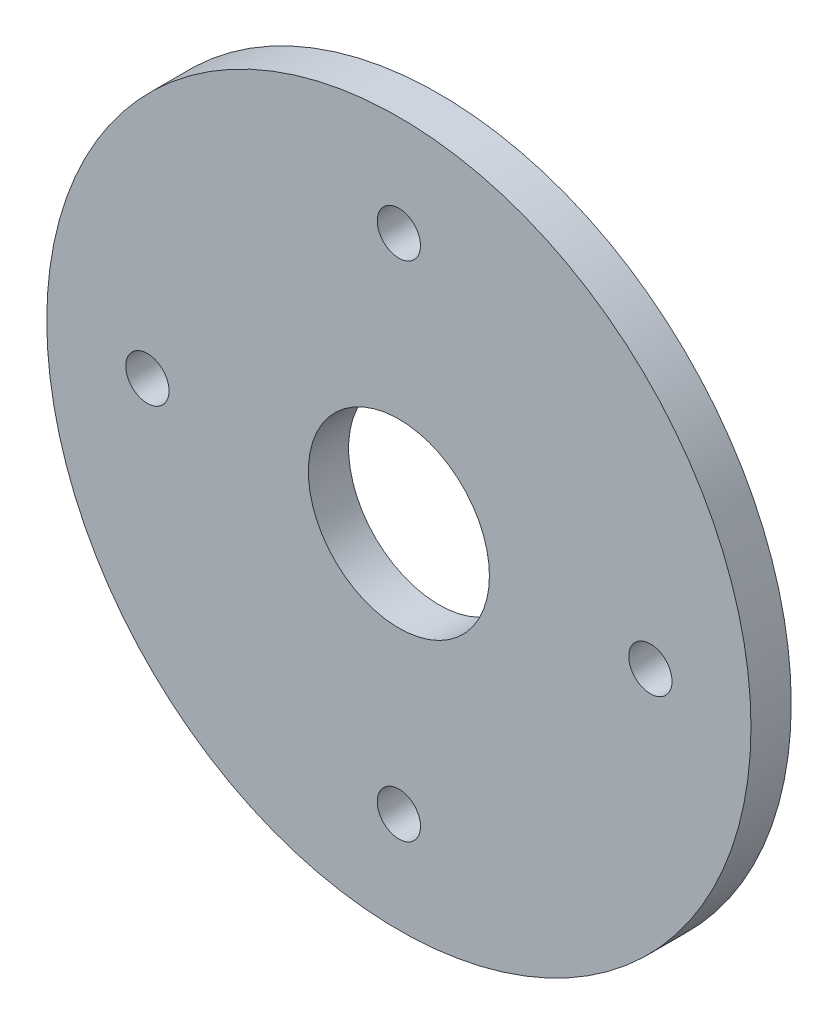
ISO-10303-21;
HEADER;
FILE_DESCRIPTION(('STEP AP214'),'2;1');
FILE_NAME('part.step','',(''),(''),'','','');
FILE_SCHEMA(('AUTOMOTIVE_DESIGN { 1 0 10303 214 1 1 1 1 }'));
ENDSEC;
DATA;
#1=APPLICATION_CONTEXT('core data for automotive mechanical design processes');
#2=APPLICATION_PROTOCOL_DEFINITION('international standard','automotive_design',2000,#1);
#3=PRODUCT_CONTEXT('',#1,'mechanical');
#4=PRODUCT('Part','Part','',(#3));
#5=PRODUCT_RELATED_PRODUCT_CATEGORY('part','',(#4));
#6=PRODUCT_DEFINITION_FORMATION('','',#4);
#7=PRODUCT_DEFINITION_CONTEXT('part definition',#1,'design');
#8=PRODUCT_DEFINITION('design','',#6,#7);
#9=PRODUCT_DEFINITION_SHAPE('','',#8);
#10=(LENGTH_UNIT() NAMED_UNIT(*) SI_UNIT(.MILLI.,.METRE.));
#11=(NAMED_UNIT(*) PLANE_ANGLE_UNIT() SI_UNIT($,.RADIAN.));
#12=(NAMED_UNIT(*) SI_UNIT($,.STERADIAN.) SOLID_ANGLE_UNIT());
#13=UNCERTAINTY_MEASURE_WITH_UNIT(LENGTH_MEASURE(1.E-05),#10,'distance_accuracy_value','');
#14=(GEOMETRIC_REPRESENTATION_CONTEXT(3) GLOBAL_UNCERTAINTY_ASSIGNED_CONTEXT((#13)) GLOBAL_UNIT_ASSIGNED_CONTEXT((#10,
#11,#12)) REPRESENTATION_CONTEXT('',''));
#15=CARTESIAN_POINT('',(0.,0.,0.));
#16=DIRECTION('',(0.,0.,1.));
#17=DIRECTION('',(1.,0.,0.));
#18=AXIS2_PLACEMENT_3D('',#15,#16,#17);
#19=CARTESIAN_POINT('',(-35.,145.,4.));
#20=DIRECTION('',(0.,0.,-1.));
#21=DIRECTION('',(-1.,0.,0.));
#22=AXIS2_PLACEMENT_3D('',#19,#20,#21);
#23=CYLINDRICAL_SURFACE('',#22,9.00000000000001);
#24=CARTESIAN_POINT('',(-35.,145.,4.));
#25=DIRECTION('',(0.,0.,1.));
#26=DIRECTION('',(1.,0.,0.));
#27=AXIS2_PLACEMENT_3D('',#24,#25,#26);
#28=CIRCLE('',#27,9.00000000000001);
#29=CARTESIAN_POINT('',(-26.,145.,4.));
#30=VERTEX_POINT('',#29);
#31=EDGE_CURVE('E41',#30,#30,#28,.T.);
#32=ORIENTED_EDGE('',*,*,#31,.T.);
#33=EDGE_LOOP('',(#32));
#34=FACE_BOUND('',#33,.T.);
#35=CARTESIAN_POINT('',(-35.,145.,0.));
#36=DIRECTION('',(0.,0.,1.));
#37=DIRECTION('',(1.,0.,0.));
#38=AXIS2_PLACEMENT_3D('',#35,#36,#37);
#39=CIRCLE('',#38,9.00000000000001);
#40=CARTESIAN_POINT('',(-26.,145.,0.));
#41=VERTEX_POINT('',#40);
#42=EDGE_CURVE('E48',#41,#41,#39,.T.);
#43=ORIENTED_EDGE('',*,*,#42,.F.);
#44=EDGE_LOOP('',(#43));
#45=FACE_BOUND('',#44,.T.);
#46=ADVANCED_FACE('F34',(#34,#45),#23,.F.);
#47=CARTESIAN_POINT('',(-35.,145.,4.));
#48=DIRECTION('',(0.,0.,-1.));
#49=DIRECTION('',(-1.,0.,0.));
#50=AXIS2_PLACEMENT_3D('',#47,#48,#49);
#51=CYLINDRICAL_SURFACE('',#50,35.);
#52=CARTESIAN_POINT('',(-35.,145.,4.));
#53=DIRECTION('',(0.,0.,1.));
#54=DIRECTION('',(1.,0.,0.));
#55=AXIS2_PLACEMENT_3D('',#52,#53,#54);
#56=CIRCLE('',#55,35.);
#57=CARTESIAN_POINT('',(0.,145.,4.));
#58=VERTEX_POINT('',#57);
#59=EDGE_CURVE('E10',#58,#58,#56,.T.);
#60=ORIENTED_EDGE('',*,*,#59,.F.);
#61=EDGE_LOOP('',(#60));
#62=FACE_BOUND('',#61,.T.);
#63=CARTESIAN_POINT('',(-35.,145.,0.));
#64=DIRECTION('',(0.,0.,1.));
#65=DIRECTION('',(1.,0.,0.));
#66=AXIS2_PLACEMENT_3D('',#63,#64,#65);
#67=CIRCLE('',#66,35.);
#68=CARTESIAN_POINT('',(0.,145.,0.));
#69=VERTEX_POINT('',#68);
#70=EDGE_CURVE('E37',#69,#69,#67,.T.);
#71=ORIENTED_EDGE('',*,*,#70,.T.);
#72=EDGE_LOOP('',(#71));
#73=FACE_BOUND('',#72,.T.);
#74=ADVANCED_FACE('F86',(#62,#73),#51,.T.);
#75=CARTESIAN_POINT('',(0.,0.,4.));
#76=DIRECTION('',(0.,0.,1.));
#77=DIRECTION('',(1.,0.,0.));
#78=AXIS2_PLACEMENT_3D('',#75,#76,#77);
#79=PLANE('',#78);
#80=CARTESIAN_POINT('',(-35.,170.,4.));
#81=DIRECTION('',(0.,0.,1.));
#82=DIRECTION('',(1.,0.,0.));
#83=AXIS2_PLACEMENT_3D('',#80,#81,#82);
#84=CIRCLE('',#83,2.15);
#85=CARTESIAN_POINT('',(-32.85,170.,4.));
#86=VERTEX_POINT('',#85);
#87=EDGE_CURVE('E76',#86,#86,#84,.T.);
#88=ORIENTED_EDGE('',*,*,#87,.F.);
#89=EDGE_LOOP('',(#88));
#90=FACE_BOUND('',#89,.T.);
#91=CARTESIAN_POINT('',(-9.99999999999999,145.,4.));
#92=DIRECTION('',(0.,0.,1.));
#93=DIRECTION('',(1.,0.,0.));
#94=AXIS2_PLACEMENT_3D('',#91,#92,#93);
#95=CIRCLE('',#94,2.15);
#96=CARTESIAN_POINT('',(-7.85,145.,4.));
#97=VERTEX_POINT('',#96);
#98=EDGE_CURVE('E70',#97,#97,#95,.T.);
#99=ORIENTED_EDGE('',*,*,#98,.F.);
#100=EDGE_LOOP('',(#99));
#101=FACE_BOUND('',#100,.T.);
#102=CARTESIAN_POINT('',(-35.,120.,4.));
#103=DIRECTION('',(0.,0.,1.));
#104=DIRECTION('',(1.,0.,0.));
#105=AXIS2_PLACEMENT_3D('',#102,#103,#104);
#106=CIRCLE('',#105,2.15);
#107=CARTESIAN_POINT('',(-32.85,120.,4.));
#108=VERTEX_POINT('',#107);
#109=EDGE_CURVE('E64',#108,#108,#106,.T.);
#110=ORIENTED_EDGE('',*,*,#109,.F.);
#111=EDGE_LOOP('',(#110));
#112=FACE_BOUND('',#111,.T.);
#113=CARTESIAN_POINT('',(-60.,145.,4.));
#114=DIRECTION('',(0.,0.,1.));
#115=DIRECTION('',(1.,0.,0.));
#116=AXIS2_PLACEMENT_3D('',#113,#114,#115);
#117=CIRCLE('',#116,2.15);
#118=CARTESIAN_POINT('',(-57.85,145.,4.));
#119=VERTEX_POINT('',#118);
#120=EDGE_CURVE('E55',#119,#119,#117,.T.);
#121=ORIENTED_EDGE('',*,*,#120,.F.);
#122=EDGE_LOOP('',(#121));
#123=FACE_BOUND('',#122,.T.);
#124=ORIENTED_EDGE('',*,*,#31,.F.);
#125=EDGE_LOOP('',(#124));
#126=FACE_BOUND('',#125,.T.);
#127=ORIENTED_EDGE('',*,*,#59,.T.);
#128=EDGE_LOOP('',(#127));
#129=FACE_BOUND('',#128,.T.);
#130=ADVANCED_FACE('F82',(#90,#101,#112,#123,#126,#129),#79,.T.);
#131=CARTESIAN_POINT('',(0.,0.,0.));
#132=DIRECTION('',(0.,0.,1.));
#133=DIRECTION('',(1.,0.,0.));
#134=AXIS2_PLACEMENT_3D('',#131,#132,#133);
#135=PLANE('',#134);
#136=CARTESIAN_POINT('',(-35.,170.,0.));
#137=DIRECTION('',(0.,0.,1.));
#138=DIRECTION('',(1.,0.,0.));
#139=AXIS2_PLACEMENT_3D('',#136,#137,#138);
#140=CIRCLE('',#139,2.15);
#141=CARTESIAN_POINT('',(-32.85,170.,0.));
#142=VERTEX_POINT('',#141);
#143=EDGE_CURVE('E73',#142,#142,#140,.T.);
#144=ORIENTED_EDGE('',*,*,#143,.T.);
#145=EDGE_LOOP('',(#144));
#146=FACE_BOUND('',#145,.T.);
#147=CARTESIAN_POINT('',(-9.99999999999999,145.,0.));
#148=DIRECTION('',(0.,0.,1.));
#149=DIRECTION('',(1.,0.,0.));
#150=AXIS2_PLACEMENT_3D('',#147,#148,#149);
#151=CIRCLE('',#150,2.15);
#152=CARTESIAN_POINT('',(-7.85,145.,0.));
#153=VERTEX_POINT('',#152);
#154=EDGE_CURVE('E67',#153,#153,#151,.T.);
#155=ORIENTED_EDGE('',*,*,#154,.T.);
#156=EDGE_LOOP('',(#155));
#157=FACE_BOUND('',#156,.T.);
#158=CARTESIAN_POINT('',(-35.,120.,0.));
#159=DIRECTION('',(0.,0.,1.));
#160=DIRECTION('',(1.,0.,0.));
#161=AXIS2_PLACEMENT_3D('',#158,#159,#160);
#162=CIRCLE('',#161,2.15);
#163=CARTESIAN_POINT('',(-32.85,120.,0.));
#164=VERTEX_POINT('',#163);
#165=EDGE_CURVE('E59',#164,#164,#162,.T.);
#166=ORIENTED_EDGE('',*,*,#165,.T.);
#167=EDGE_LOOP('',(#166));
#168=FACE_BOUND('',#167,.T.);
#169=CARTESIAN_POINT('',(-60.,145.,0.));
#170=DIRECTION('',(0.,0.,1.));
#171=DIRECTION('',(1.,0.,0.));
#172=AXIS2_PLACEMENT_3D('',#169,#170,#171);
#173=CIRCLE('',#172,2.15);
#174=CARTESIAN_POINT('',(-57.85,145.,0.));
#175=VERTEX_POINT('',#174);
#176=EDGE_CURVE('E50',#175,#175,#173,.T.);
#177=ORIENTED_EDGE('',*,*,#176,.T.);
#178=EDGE_LOOP('',(#177));
#179=FACE_BOUND('',#178,.T.);
#180=ORIENTED_EDGE('',*,*,#42,.T.);
#181=EDGE_LOOP('',(#180));
#182=FACE_BOUND('',#181,.T.);
#183=ORIENTED_EDGE('',*,*,#70,.F.);
#184=EDGE_LOOP('',(#183));
#185=FACE_BOUND('',#184,.T.);
#186=ADVANCED_FACE('F85',(#146,#157,#168,#179,#182,#185),#135,.F.);
#187=CARTESIAN_POINT('',(-60.,145.,4.));
#188=DIRECTION('',(0.,0.,1.));
#189=DIRECTION('',(1.,0.,0.));
#190=AXIS2_PLACEMENT_3D('',#187,#188,#189);
#191=CYLINDRICAL_SURFACE('',#190,2.15);
#192=ORIENTED_EDGE('',*,*,#176,.F.);
#193=EDGE_LOOP('',(#192));
#194=FACE_BOUND('',#193,.T.);
#195=ORIENTED_EDGE('',*,*,#120,.T.);
#196=EDGE_LOOP('',(#195));
#197=FACE_BOUND('',#196,.T.);
#198=ADVANCED_FACE('F107',(#194,#197),#191,.F.);
#199=CARTESIAN_POINT('',(-35.,120.,4.));
#200=DIRECTION('',(0.,0.,1.));
#201=DIRECTION('',(1.,0.,0.));
#202=AXIS2_PLACEMENT_3D('',#199,#200,#201);
#203=CYLINDRICAL_SURFACE('',#202,2.15);
#204=ORIENTED_EDGE('',*,*,#165,.F.);
#205=EDGE_LOOP('',(#204));
#206=FACE_BOUND('',#205,.T.);
#207=ORIENTED_EDGE('',*,*,#109,.T.);
#208=EDGE_LOOP('',(#207));
#209=FACE_BOUND('',#208,.T.);
#210=ADVANCED_FACE('F112',(#206,#209),#203,.F.);
#211=CARTESIAN_POINT('',(-9.99999999999999,145.,4.));
#212=DIRECTION('',(0.,0.,1.));
#213=DIRECTION('',(1.,0.,0.));
#214=AXIS2_PLACEMENT_3D('',#211,#212,#213);
#215=CYLINDRICAL_SURFACE('',#214,2.15);
#216=ORIENTED_EDGE('',*,*,#154,.F.);
#217=EDGE_LOOP('',(#216));
#218=FACE_BOUND('',#217,.T.);
#219=ORIENTED_EDGE('',*,*,#98,.T.);
#220=EDGE_LOOP('',(#219));
#221=FACE_BOUND('',#220,.T.);
#222=ADVANCED_FACE('F116',(#218,#221),#215,.F.);
#223=CARTESIAN_POINT('',(-35.,170.,4.));
#224=DIRECTION('',(0.,0.,1.));
#225=DIRECTION('',(1.,0.,0.));
#226=AXIS2_PLACEMENT_3D('',#223,#224,#225);
#227=CYLINDRICAL_SURFACE('',#226,2.15);
#228=ORIENTED_EDGE('',*,*,#143,.F.);
#229=EDGE_LOOP('',(#228));
#230=FACE_BOUND('',#229,.T.);
#231=ORIENTED_EDGE('',*,*,#87,.T.);
#232=EDGE_LOOP('',(#231));
#233=FACE_BOUND('',#232,.T.);
#234=ADVANCED_FACE('F80',(#230,#233),#227,.F.);
#235=CLOSED_SHELL('',(#46,#74,#130,#186,#198,#210,#222,#234));
#236=MANIFOLD_SOLID_BREP('B2',#235);
#237=ADVANCED_BREP_SHAPE_REPRESENTATION('',(#18,#236),#14);
#238=SHAPE_DEFINITION_REPRESENTATION(#9,#237);
ENDSEC;
END-ISO-10303-21;
